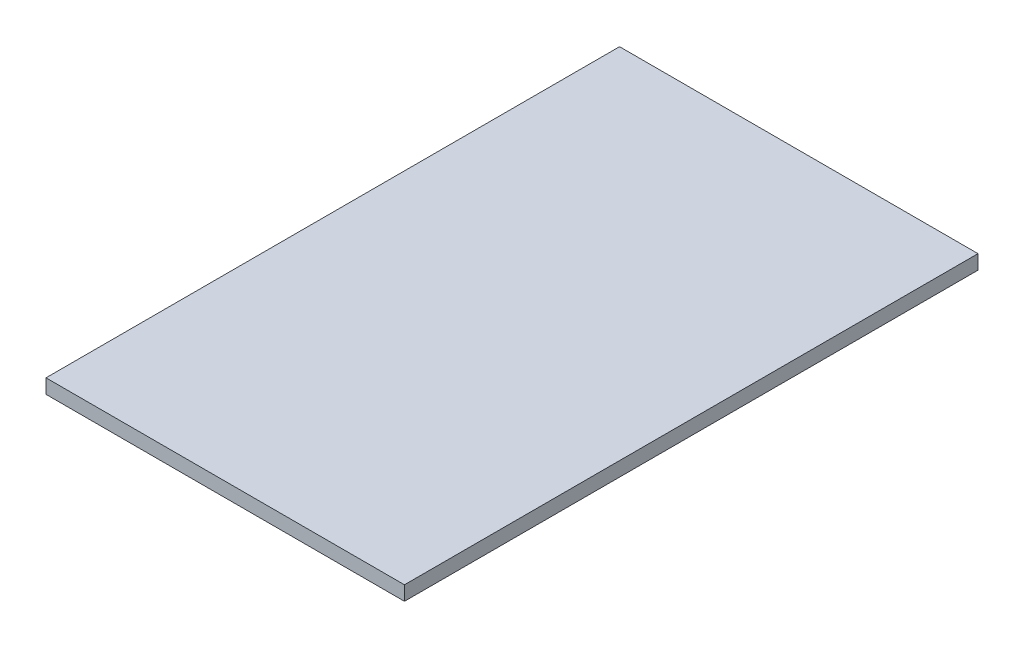
ISO-10303-21;
HEADER;
FILE_DESCRIPTION(('STEP AP214'),'2;1');
FILE_NAME('part.step','',(''),(''),'','','');
FILE_SCHEMA(('AUTOMOTIVE_DESIGN { 1 0 10303 214 1 1 1 1 }'));
ENDSEC;
DATA;
#1=APPLICATION_CONTEXT('core data for automotive mechanical design processes');
#2=APPLICATION_PROTOCOL_DEFINITION('international standard','automotive_design',2000,#1);
#3=PRODUCT_CONTEXT('',#1,'mechanical');
#4=PRODUCT('Part','Part','',(#3));
#5=PRODUCT_RELATED_PRODUCT_CATEGORY('part','',(#4));
#6=PRODUCT_DEFINITION_FORMATION('','',#4);
#7=PRODUCT_DEFINITION_CONTEXT('part definition',#1,'design');
#8=PRODUCT_DEFINITION('design','',#6,#7);
#9=PRODUCT_DEFINITION_SHAPE('','',#8);
#10=(LENGTH_UNIT() NAMED_UNIT(*) SI_UNIT(.MILLI.,.METRE.));
#11=(NAMED_UNIT(*) PLANE_ANGLE_UNIT() SI_UNIT($,.RADIAN.));
#12=(NAMED_UNIT(*) SI_UNIT($,.STERADIAN.) SOLID_ANGLE_UNIT());
#13=UNCERTAINTY_MEASURE_WITH_UNIT(LENGTH_MEASURE(1.E-05),#10,'distance_accuracy_value','');
#14=(GEOMETRIC_REPRESENTATION_CONTEXT(3) GLOBAL_UNCERTAINTY_ASSIGNED_CONTEXT((#13)) GLOBAL_UNIT_ASSIGNED_CONTEXT((#10,
#11,#12)) REPRESENTATION_CONTEXT('',''));
#15=CARTESIAN_POINT('',(0.,0.,0.));
#16=DIRECTION('',(0.,0.,1.));
#17=DIRECTION('',(1.,0.,0.));
#18=AXIS2_PLACEMENT_3D('',#15,#16,#17);
#19=CARTESIAN_POINT('',(0.,-0.25,0.));
#20=DIRECTION('',(0.,1.,0.));
#21=DIRECTION('',(0.,0.,1.));
#22=AXIS2_PLACEMENT_3D('',#19,#20,#21);
#23=PLANE('',#22);
#24=DIRECTION('',(1.,0.,0.));
#25=VECTOR('',#24,1.);
#26=CARTESIAN_POINT('',(0.,-0.25,-1.));
#27=LINE('',#26,#25);
#28=CARTESIAN_POINT('',(-1.2,-0.25,-1.));
#29=VERTEX_POINT('',#28);
#30=CARTESIAN_POINT('',(-2.45,-0.25,-1.));
#31=VERTEX_POINT('',#30);
#32=EDGE_CURVE('E19',#29,#31,#27,.F.);
#33=ORIENTED_EDGE('',*,*,#32,.F.);
#34=DIRECTION('',(0.,0.,-1.));
#35=VECTOR('',#34,1.);
#36=CARTESIAN_POINT('',(-1.2,-0.25,1.));
#37=LINE('',#36,#35);
#38=CARTESIAN_POINT('',(-1.2,-0.25,1.));
#39=VERTEX_POINT('',#38);
#40=EDGE_CURVE('E68',#39,#29,#37,.T.);
#41=ORIENTED_EDGE('',*,*,#40,.F.);
#42=DIRECTION('',(1.,0.,0.));
#43=VECTOR('',#42,1.);
#44=CARTESIAN_POINT('',(-1.2,-0.25,1.));
#45=LINE('',#44,#43);
#46=CARTESIAN_POINT('',(-2.45,-0.25,1.));
#47=VERTEX_POINT('',#46);
#48=EDGE_CURVE('E55',#47,#39,#45,.T.);
#49=ORIENTED_EDGE('',*,*,#48,.F.);
#50=DIRECTION('',(0.,0.,1.));
#51=VECTOR('',#50,1.);
#52=CARTESIAN_POINT('',(-2.45,-0.25,1.));
#53=LINE('',#52,#51);
#54=EDGE_CURVE('E61',#31,#47,#53,.T.);
#55=ORIENTED_EDGE('',*,*,#54,.F.);
#56=EDGE_LOOP('',(#33,#41,#49,#55));
#57=FACE_BOUND('',#56,.T.);
#58=ADVANCED_FACE('F16',(#57),#23,.F.);
#59=CARTESIAN_POINT('',(-2.45,2.158495283014,1.));
#60=DIRECTION('',(-1.,0.,0.));
#61=DIRECTION('',(0.,0.,1.));
#62=AXIS2_PLACEMENT_3D('',#59,#60,#61);
#63=PLANE('',#62);
#64=DIRECTION('',(0.,1.,0.));
#65=VECTOR('',#64,1.);
#66=CARTESIAN_POINT('',(-2.45,2.158495283014,-1.));
#67=LINE('',#66,#65);
#68=CARTESIAN_POINT('',(-2.45,-0.2,-1.));
#69=VERTEX_POINT('',#68);
#70=EDGE_CURVE('E66',#31,#69,#67,.T.);
#71=ORIENTED_EDGE('',*,*,#70,.F.);
#72=ORIENTED_EDGE('',*,*,#54,.T.);
#73=DIRECTION('',(0.,1.,0.));
#74=VECTOR('',#73,1.);
#75=CARTESIAN_POINT('',(-2.45,2.158495283014,1.));
#76=LINE('',#75,#74);
#77=CARTESIAN_POINT('',(-2.45,-0.2,1.));
#78=VERTEX_POINT('',#77);
#79=EDGE_CURVE('E63',#78,#47,#76,.F.);
#80=ORIENTED_EDGE('',*,*,#79,.F.);
#81=DIRECTION('',(0.,0.,1.));
#82=VECTOR('',#81,1.);
#83=CARTESIAN_POINT('',(-2.45,-0.2,0.));
#84=LINE('',#83,#82);
#85=EDGE_CURVE('E82',#69,#78,#84,.T.);
#86=ORIENTED_EDGE('',*,*,#85,.F.);
#87=EDGE_LOOP('',(#71,#72,#80,#86));
#88=FACE_BOUND('',#87,.T.);
#89=ADVANCED_FACE('F62',(#88),#63,.T.);
#90=CARTESIAN_POINT('',(-1.2,2.158495283014,1.));
#91=DIRECTION('',(0.,0.,1.));
#92=DIRECTION('',(1.,0.,0.));
#93=AXIS2_PLACEMENT_3D('',#90,#91,#92);
#94=PLANE('',#93);
#95=ORIENTED_EDGE('',*,*,#79,.T.);
#96=ORIENTED_EDGE('',*,*,#48,.T.);
#97=DIRECTION('',(0.,1.,0.));
#98=VECTOR('',#97,1.);
#99=CARTESIAN_POINT('',(-1.2,2.158495283014,1.));
#100=LINE('',#99,#98);
#101=CARTESIAN_POINT('',(-1.2,-0.2,1.));
#102=VERTEX_POINT('',#101);
#103=EDGE_CURVE('E70',#102,#39,#100,.F.);
#104=ORIENTED_EDGE('',*,*,#103,.F.);
#105=DIRECTION('',(1.,0.,0.));
#106=VECTOR('',#105,1.);
#107=CARTESIAN_POINT('',(0.,-0.2,1.));
#108=LINE('',#107,#106);
#109=EDGE_CURVE('E74',#78,#102,#108,.T.);
#110=ORIENTED_EDGE('',*,*,#109,.F.);
#111=EDGE_LOOP('',(#95,#96,#104,#110));
#112=FACE_BOUND('',#111,.T.);
#113=ADVANCED_FACE('F72',(#112),#94,.T.);
#114=CARTESIAN_POINT('',(-1.2,2.158495283014,1.));
#115=DIRECTION('',(1.,0.,0.));
#116=DIRECTION('',(0.,0.,-1.));
#117=AXIS2_PLACEMENT_3D('',#114,#115,#116);
#118=PLANE('',#117);
#119=ORIENTED_EDGE('',*,*,#103,.T.);
#120=ORIENTED_EDGE('',*,*,#40,.T.);
#121=DIRECTION('',(0.,1.,0.));
#122=VECTOR('',#121,1.);
#123=CARTESIAN_POINT('',(-1.2,2.158495283014,-1.));
#124=LINE('',#123,#122);
#125=CARTESIAN_POINT('',(-1.2,-0.2,-1.));
#126=VERTEX_POINT('',#125);
#127=EDGE_CURVE('E34',#126,#29,#124,.F.);
#128=ORIENTED_EDGE('',*,*,#127,.F.);
#129=DIRECTION('',(0.,0.,1.));
#130=VECTOR('',#129,1.);
#131=CARTESIAN_POINT('',(-1.2,-0.2,0.));
#132=LINE('',#131,#130);
#133=EDGE_CURVE('E25',#102,#126,#132,.F.);
#134=ORIENTED_EDGE('',*,*,#133,.F.);
#135=EDGE_LOOP('',(#119,#120,#128,#134));
#136=FACE_BOUND('',#135,.T.);
#137=ADVANCED_FACE('F88',(#136),#118,.T.);
#138=CARTESIAN_POINT('',(-1.2,2.158495283014,-1.));
#139=DIRECTION('',(0.,0.,-1.));
#140=DIRECTION('',(-1.,0.,0.));
#141=AXIS2_PLACEMENT_3D('',#138,#139,#140);
#142=PLANE('',#141);
#143=ORIENTED_EDGE('',*,*,#127,.T.);
#144=ORIENTED_EDGE('',*,*,#32,.T.);
#145=ORIENTED_EDGE('',*,*,#70,.T.);
#146=DIRECTION('',(1.,0.,0.));
#147=VECTOR('',#146,1.);
#148=CARTESIAN_POINT('',(0.,-0.2,-1.));
#149=LINE('',#148,#147);
#150=EDGE_CURVE('E11',#126,#69,#149,.F.);
#151=ORIENTED_EDGE('',*,*,#150,.F.);
#152=EDGE_LOOP('',(#143,#144,#145,#151));
#153=FACE_BOUND('',#152,.T.);
#154=ADVANCED_FACE('F90',(#153),#142,.T.);
#155=CARTESIAN_POINT('',(0.,-0.2,0.));
#156=DIRECTION('',(0.,1.,0.));
#157=DIRECTION('',(0.,0.,1.));
#158=AXIS2_PLACEMENT_3D('',#155,#156,#157);
#159=PLANE('',#158);
#160=ORIENTED_EDGE('',*,*,#133,.T.);
#161=ORIENTED_EDGE('',*,*,#150,.T.);
#162=ORIENTED_EDGE('',*,*,#85,.T.);
#163=ORIENTED_EDGE('',*,*,#109,.T.);
#164=EDGE_LOOP('',(#160,#161,#162,#163));
#165=FACE_BOUND('',#164,.T.);
#166=ADVANCED_FACE('F87',(#165),#159,.T.);
#167=CLOSED_SHELL('',(#58,#89,#113,#137,#154,#166));
#168=MANIFOLD_SOLID_BREP('B1',#167);
#169=ADVANCED_BREP_SHAPE_REPRESENTATION('',(#18,#168),#14);
#170=SHAPE_DEFINITION_REPRESENTATION(#9,#169);
ENDSEC;
END-ISO-10303-21;
